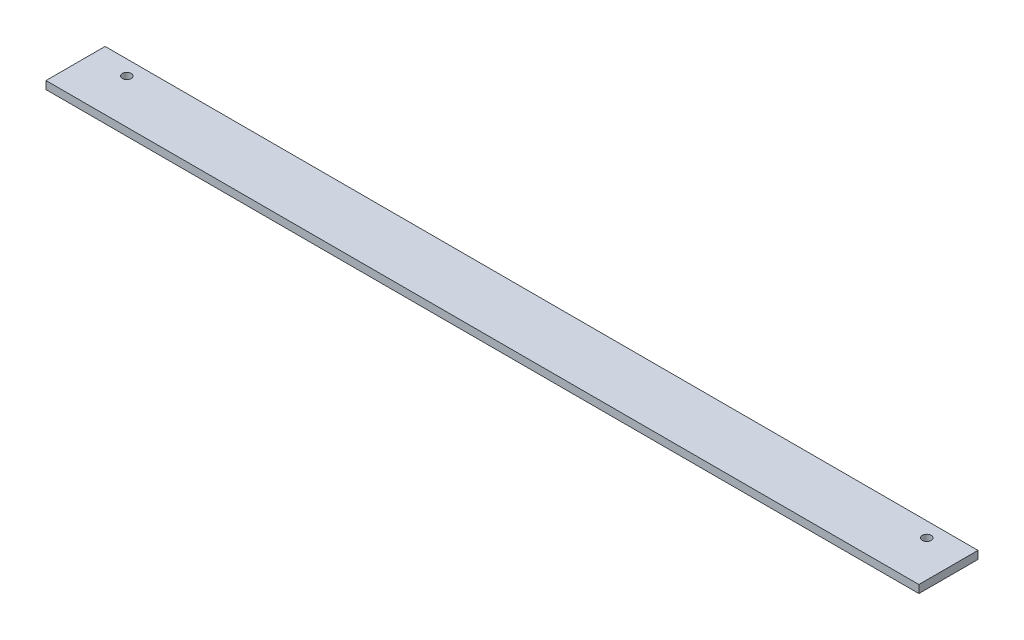
ISO-10303-21;
HEADER;
FILE_DESCRIPTION(('STEP AP214'),'2;1');
FILE_NAME('part.step','',(''),(''),'','','');
FILE_SCHEMA(('AUTOMOTIVE_DESIGN { 1 0 10303 214 1 1 1 1 }'));
ENDSEC;
DATA;
#1=APPLICATION_CONTEXT('core data for automotive mechanical design processes');
#2=APPLICATION_PROTOCOL_DEFINITION('international standard','automotive_design',2000,#1);
#3=PRODUCT_CONTEXT('',#1,'mechanical');
#4=PRODUCT('Part','Part','',(#3));
#5=PRODUCT_RELATED_PRODUCT_CATEGORY('part','',(#4));
#6=PRODUCT_DEFINITION_FORMATION('','',#4);
#7=PRODUCT_DEFINITION_CONTEXT('part definition',#1,'design');
#8=PRODUCT_DEFINITION('design','',#6,#7);
#9=PRODUCT_DEFINITION_SHAPE('','',#8);
#10=(LENGTH_UNIT() NAMED_UNIT(*) SI_UNIT(.MILLI.,.METRE.));
#11=(NAMED_UNIT(*) PLANE_ANGLE_UNIT() SI_UNIT($,.RADIAN.));
#12=(NAMED_UNIT(*) SI_UNIT($,.STERADIAN.) SOLID_ANGLE_UNIT());
#13=UNCERTAINTY_MEASURE_WITH_UNIT(LENGTH_MEASURE(1.E-05),#10,'distance_accuracy_value','');
#14=(GEOMETRIC_REPRESENTATION_CONTEXT(3) GLOBAL_UNCERTAINTY_ASSIGNED_CONTEXT((#13)) GLOBAL_UNIT_ASSIGNED_CONTEXT((#10,
#11,#12)) REPRESENTATION_CONTEXT('',''));
#15=CARTESIAN_POINT('',(0.,0.,0.));
#16=DIRECTION('',(0.,0.,1.));
#17=DIRECTION('',(1.,0.,0.));
#18=AXIS2_PLACEMENT_3D('',#15,#16,#17);
#19=CARTESIAN_POINT('',(443.,-2.,-15.));
#20=DIRECTION('',(0.,0.,1.));
#21=DIRECTION('',(1.,0.,0.));
#22=AXIS2_PLACEMENT_3D('',#19,#20,#21);
#23=PLANE('',#22);
#24=DIRECTION('',(0.,1.,0.));
#25=VECTOR('',#24,1.);
#26=CARTESIAN_POINT('',(0.,-2.,-15.));
#27=LINE('',#26,#25);
#28=CARTESIAN_POINT('',(0.,-2.,-15.));
#29=VERTEX_POINT('',#28);
#30=CARTESIAN_POINT('',(0.,2.,-15.));
#31=VERTEX_POINT('',#30);
#32=EDGE_CURVE('E97',#29,#31,#27,.T.);
#33=ORIENTED_EDGE('',*,*,#32,.T.);
#34=DIRECTION('',(-1.,0.,0.));
#35=VECTOR('',#34,1.);
#36=CARTESIAN_POINT('',(443.,2.,-15.));
#37=LINE('',#36,#35);
#38=CARTESIAN_POINT('',(443.,2.,-15.));
#39=VERTEX_POINT('',#38);
#40=EDGE_CURVE('E11',#39,#31,#37,.T.);
#41=ORIENTED_EDGE('',*,*,#40,.F.);
#42=DIRECTION('',(0.,1.,0.));
#43=VECTOR('',#42,1.);
#44=CARTESIAN_POINT('',(443.,-2.,-15.));
#45=LINE('',#44,#43);
#46=CARTESIAN_POINT('',(443.,-2.,-15.));
#47=VERTEX_POINT('',#46);
#48=EDGE_CURVE('E85',#47,#39,#45,.T.);
#49=ORIENTED_EDGE('',*,*,#48,.F.);
#50=DIRECTION('',(-1.,0.,0.));
#51=VECTOR('',#50,1.);
#52=CARTESIAN_POINT('',(443.,-2.,-15.));
#53=LINE('',#52,#51);
#54=EDGE_CURVE('E93',#47,#29,#53,.T.);
#55=ORIENTED_EDGE('',*,*,#54,.T.);
#56=EDGE_LOOP('',(#33,#41,#49,#55));
#57=FACE_BOUND('',#56,.T.);
#58=ADVANCED_FACE('F34',(#57),#23,.F.);
#59=CARTESIAN_POINT('',(443.,2.,15.));
#60=DIRECTION('',(0.,-1.,0.));
#61=DIRECTION('',(0.,0.,-1.));
#62=AXIS2_PLACEMENT_3D('',#59,#60,#61);
#63=PLANE('',#62);
#64=CARTESIAN_POINT('',(18.5,2.,-7.5));
#65=DIRECTION('',(0.,1.,0.));
#66=DIRECTION('',(0.,0.,1.));
#67=AXIS2_PLACEMENT_3D('',#64,#65,#66);
#68=CIRCLE('',#67,2.25);
#69=CARTESIAN_POINT('',(18.5,2.,-5.25));
#70=VERTEX_POINT('',#69);
#71=EDGE_CURVE('E117',#70,#70,#68,.T.);
#72=ORIENTED_EDGE('',*,*,#71,.F.);
#73=EDGE_LOOP('',(#72));
#74=FACE_BOUND('',#73,.T.);
#75=CARTESIAN_POINT('',(424.5,2.,-7.5));
#76=DIRECTION('',(0.,1.,0.));
#77=DIRECTION('',(0.,0.,1.));
#78=AXIS2_PLACEMENT_3D('',#75,#76,#77);
#79=CIRCLE('',#78,2.24999999999995);
#80=CARTESIAN_POINT('',(424.5,2.,-5.25000000000005));
#81=VERTEX_POINT('',#80);
#82=EDGE_CURVE('E111',#81,#81,#79,.T.);
#83=ORIENTED_EDGE('',*,*,#82,.F.);
#84=EDGE_LOOP('',(#83));
#85=FACE_BOUND('',#84,.T.);
#86=DIRECTION('',(0.,0.,1.));
#87=VECTOR('',#86,1.);
#88=CARTESIAN_POINT('',(0.,2.,15.));
#89=LINE('',#88,#87);
#90=CARTESIAN_POINT('',(0.,2.,15.));
#91=VERTEX_POINT('',#90);
#92=EDGE_CURVE('E89',#31,#91,#89,.T.);
#93=ORIENTED_EDGE('',*,*,#92,.T.);
#94=DIRECTION('',(-1.,0.,0.));
#95=VECTOR('',#94,1.);
#96=CARTESIAN_POINT('',(443.,2.,15.));
#97=LINE('',#96,#95);
#98=CARTESIAN_POINT('',(443.,2.,15.));
#99=VERTEX_POINT('',#98);
#100=EDGE_CURVE('E42',#99,#91,#97,.T.);
#101=ORIENTED_EDGE('',*,*,#100,.F.);
#102=DIRECTION('',(0.,0.,1.));
#103=VECTOR('',#102,1.);
#104=CARTESIAN_POINT('',(443.,2.,15.));
#105=LINE('',#104,#103);
#106=EDGE_CURVE('E80',#39,#99,#105,.T.);
#107=ORIENTED_EDGE('',*,*,#106,.F.);
#108=ORIENTED_EDGE('',*,*,#40,.T.);
#109=EDGE_LOOP('',(#93,#101,#107,#108));
#110=FACE_BOUND('',#109,.T.);
#111=ADVANCED_FACE('F88',(#74,#85,#110),#63,.F.);
#112=CARTESIAN_POINT('',(443.,-2.,15.));
#113=DIRECTION('',(0.,0.,-1.));
#114=DIRECTION('',(-1.,0.,0.));
#115=AXIS2_PLACEMENT_3D('',#112,#113,#114);
#116=PLANE('',#115);
#117=DIRECTION('',(0.,-1.,0.));
#118=VECTOR('',#117,1.);
#119=CARTESIAN_POINT('',(0.,-2.,15.));
#120=LINE('',#119,#118);
#121=CARTESIAN_POINT('',(0.,-2.,15.));
#122=VERTEX_POINT('',#121);
#123=EDGE_CURVE('E67',#91,#122,#120,.T.);
#124=ORIENTED_EDGE('',*,*,#123,.T.);
#125=DIRECTION('',(-1.,0.,0.));
#126=VECTOR('',#125,1.);
#127=CARTESIAN_POINT('',(443.,-2.,15.));
#128=LINE('',#127,#126);
#129=CARTESIAN_POINT('',(443.,-2.,15.));
#130=VERTEX_POINT('',#129);
#131=EDGE_CURVE('E90',#130,#122,#128,.T.);
#132=ORIENTED_EDGE('',*,*,#131,.F.);
#133=DIRECTION('',(0.,-1.,0.));
#134=VECTOR('',#133,1.);
#135=CARTESIAN_POINT('',(443.,-2.,15.));
#136=LINE('',#135,#134);
#137=EDGE_CURVE('E83',#99,#130,#136,.T.);
#138=ORIENTED_EDGE('',*,*,#137,.F.);
#139=ORIENTED_EDGE('',*,*,#100,.T.);
#140=EDGE_LOOP('',(#124,#132,#138,#139));
#141=FACE_BOUND('',#140,.T.);
#142=ADVANCED_FACE('F91',(#141),#116,.F.);
#143=CARTESIAN_POINT('',(443.,-2.,15.));
#144=DIRECTION('',(0.,1.,0.));
#145=DIRECTION('',(0.,0.,1.));
#146=AXIS2_PLACEMENT_3D('',#143,#144,#145);
#147=PLANE('',#146);
#148=CARTESIAN_POINT('',(18.5,-2.,-7.5));
#149=DIRECTION('',(0.,1.,0.));
#150=DIRECTION('',(0.,0.,1.));
#151=AXIS2_PLACEMENT_3D('',#148,#149,#150);
#152=CIRCLE('',#151,2.25);
#153=CARTESIAN_POINT('',(18.5,-2.,-5.25));
#154=VERTEX_POINT('',#153);
#155=EDGE_CURVE('E100',#154,#154,#152,.T.);
#156=ORIENTED_EDGE('',*,*,#155,.T.);
#157=EDGE_LOOP('',(#156));
#158=FACE_BOUND('',#157,.T.);
#159=CARTESIAN_POINT('',(424.5,-2.,-7.5));
#160=DIRECTION('',(0.,1.,0.));
#161=DIRECTION('',(0.,0.,1.));
#162=AXIS2_PLACEMENT_3D('',#159,#160,#161);
#163=CIRCLE('',#162,2.24999999999995);
#164=CARTESIAN_POINT('',(424.5,-2.,-5.25000000000005));
#165=VERTEX_POINT('',#164);
#166=EDGE_CURVE('E114',#165,#165,#163,.T.);
#167=ORIENTED_EDGE('',*,*,#166,.T.);
#168=EDGE_LOOP('',(#167));
#169=FACE_BOUND('',#168,.T.);
#170=DIRECTION('',(0.,0.,-1.));
#171=VECTOR('',#170,1.);
#172=CARTESIAN_POINT('',(0.,-2.,15.));
#173=LINE('',#172,#171);
#174=EDGE_CURVE('E73',#122,#29,#173,.T.);
#175=ORIENTED_EDGE('',*,*,#174,.T.);
#176=ORIENTED_EDGE('',*,*,#54,.F.);
#177=DIRECTION('',(0.,0.,-1.));
#178=VECTOR('',#177,1.);
#179=CARTESIAN_POINT('',(443.,-2.,15.));
#180=LINE('',#179,#178);
#181=EDGE_CURVE('E50',#130,#47,#180,.T.);
#182=ORIENTED_EDGE('',*,*,#181,.F.);
#183=ORIENTED_EDGE('',*,*,#131,.T.);
#184=EDGE_LOOP('',(#175,#176,#182,#183));
#185=FACE_BOUND('',#184,.T.);
#186=ADVANCED_FACE('F105',(#158,#169,#185),#147,.F.);
#187=CARTESIAN_POINT('',(443.,0.,0.));
#188=DIRECTION('',(-1.,0.,0.));
#189=DIRECTION('',(0.,0.,1.));
#190=AXIS2_PLACEMENT_3D('',#187,#188,#189);
#191=PLANE('',#190);
#192=ORIENTED_EDGE('',*,*,#48,.T.);
#193=ORIENTED_EDGE('',*,*,#106,.T.);
#194=ORIENTED_EDGE('',*,*,#137,.T.);
#195=ORIENTED_EDGE('',*,*,#181,.T.);
#196=EDGE_LOOP('',(#192,#193,#194,#195));
#197=FACE_BOUND('',#196,.T.);
#198=ADVANCED_FACE('F81',(#197),#191,.F.);
#199=CARTESIAN_POINT('',(0.,0.,0.));
#200=DIRECTION('',(-1.,0.,0.));
#201=DIRECTION('',(0.,0.,1.));
#202=AXIS2_PLACEMENT_3D('',#199,#200,#201);
#203=PLANE('',#202);
#204=ORIENTED_EDGE('',*,*,#32,.F.);
#205=ORIENTED_EDGE('',*,*,#174,.F.);
#206=ORIENTED_EDGE('',*,*,#123,.F.);
#207=ORIENTED_EDGE('',*,*,#92,.F.);
#208=EDGE_LOOP('',(#204,#205,#206,#207));
#209=FACE_BOUND('',#208,.T.);
#210=ADVANCED_FACE('F108',(#209),#203,.T.);
#211=CARTESIAN_POINT('',(424.5,-2.,-7.5));
#212=DIRECTION('',(0.,1.,0.));
#213=DIRECTION('',(0.,0.,1.));
#214=AXIS2_PLACEMENT_3D('',#211,#212,#213);
#215=CYLINDRICAL_SURFACE('',#214,2.24999999999995);
#216=ORIENTED_EDGE('',*,*,#166,.F.);
#217=EDGE_LOOP('',(#216));
#218=FACE_BOUND('',#217,.T.);
#219=ORIENTED_EDGE('',*,*,#82,.T.);
#220=EDGE_LOOP('',(#219));
#221=FACE_BOUND('',#220,.T.);
#222=ADVANCED_FACE('F128',(#218,#221),#215,.F.);
#223=CARTESIAN_POINT('',(18.5,-2.,-7.5));
#224=DIRECTION('',(0.,1.,0.));
#225=DIRECTION('',(0.,0.,1.));
#226=AXIS2_PLACEMENT_3D('',#223,#224,#225);
#227=CYLINDRICAL_SURFACE('',#226,2.25);
#228=ORIENTED_EDGE('',*,*,#155,.F.);
#229=EDGE_LOOP('',(#228));
#230=FACE_BOUND('',#229,.T.);
#231=ORIENTED_EDGE('',*,*,#71,.T.);
#232=EDGE_LOOP('',(#231));
#233=FACE_BOUND('',#232,.T.);
#234=ADVANCED_FACE('F125',(#230,#233),#227,.F.);
#235=CLOSED_SHELL('',(#58,#111,#142,#186,#198,#210,#222,#234));
#236=MANIFOLD_SOLID_BREP('B2',#235);
#237=ADVANCED_BREP_SHAPE_REPRESENTATION('',(#18,#236),#14);
#238=SHAPE_DEFINITION_REPRESENTATION(#9,#237);
ENDSEC;
END-ISO-10303-21;
